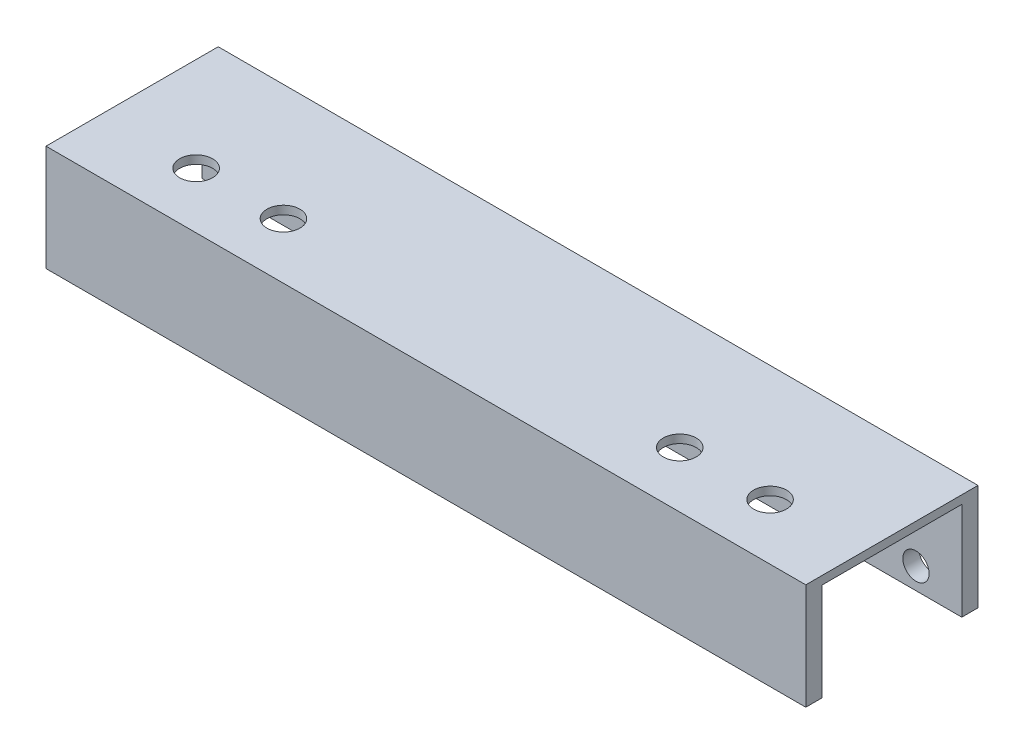
ISO-10303-21;
HEADER;
FILE_DESCRIPTION(('STEP AP214'),'2;1');
FILE_NAME('part.step','',(''),(''),'','','');
FILE_SCHEMA(('AUTOMOTIVE_DESIGN { 1 0 10303 214 1 1 1 1 }'));
ENDSEC;
DATA;
#1=APPLICATION_CONTEXT('core data for automotive mechanical design processes');
#2=APPLICATION_PROTOCOL_DEFINITION('international standard','automotive_design',2000,#1);
#3=PRODUCT_CONTEXT('',#1,'mechanical');
#4=PRODUCT('Part','Part','',(#3));
#5=PRODUCT_RELATED_PRODUCT_CATEGORY('part','',(#4));
#6=PRODUCT_DEFINITION_FORMATION('','',#4);
#7=PRODUCT_DEFINITION_CONTEXT('part definition',#1,'design');
#8=PRODUCT_DEFINITION('design','',#6,#7);
#9=PRODUCT_DEFINITION_SHAPE('','',#8);
#10=(LENGTH_UNIT() NAMED_UNIT(*) SI_UNIT(.MILLI.,.METRE.));
#11=(NAMED_UNIT(*) PLANE_ANGLE_UNIT() SI_UNIT($,.RADIAN.));
#12=(NAMED_UNIT(*) SI_UNIT($,.STERADIAN.) SOLID_ANGLE_UNIT());
#13=UNCERTAINTY_MEASURE_WITH_UNIT(LENGTH_MEASURE(1.E-05),#10,'distance_accuracy_value','');
#14=(GEOMETRIC_REPRESENTATION_CONTEXT(3) GLOBAL_UNCERTAINTY_ASSIGNED_CONTEXT((#13)) GLOBAL_UNIT_ASSIGNED_CONTEXT((#10,
#11,#12)) REPRESENTATION_CONTEXT('',''));
#15=CARTESIAN_POINT('',(0.,0.,0.));
#16=DIRECTION('',(0.,0.,1.));
#17=DIRECTION('',(1.,0.,0.));
#18=AXIS2_PLACEMENT_3D('',#15,#16,#17);
#19=CARTESIAN_POINT('',(0.,0.,31.67));
#20=DIRECTION('',(0.,1.,0.));
#21=DIRECTION('',(0.,0.,1.));
#22=AXIS2_PLACEMENT_3D('',#19,#20,#21);
#23=PLANE('',#22);
#24=DIRECTION('',(0.,0.,1.));
#25=VECTOR('',#24,1.);
#26=CARTESIAN_POINT('',(0.,0.,0.));
#27=LINE('',#26,#25);
#28=CARTESIAN_POINT('',(0.,0.,28.69));
#29=VERTEX_POINT('',#28);
#30=CARTESIAN_POINT('',(0.,0.,31.67));
#31=VERTEX_POINT('',#30);
#32=EDGE_CURVE('E141',#29,#31,#27,.T.);
#33=ORIENTED_EDGE('',*,*,#32,.F.);
#34=DIRECTION('',(-1.,0.,0.));
#35=VECTOR('',#34,1.);
#36=CARTESIAN_POINT('',(0.,0.,28.69));
#37=LINE('',#36,#35);
#38=CARTESIAN_POINT('',(139.73,0.,28.69));
#39=VERTEX_POINT('',#38);
#40=EDGE_CURVE('E121',#39,#29,#37,.T.);
#41=ORIENTED_EDGE('',*,*,#40,.F.);
#42=DIRECTION('',(0.,0.,-1.));
#43=VECTOR('',#42,1.);
#44=CARTESIAN_POINT('',(139.73,0.,0.));
#45=LINE('',#44,#43);
#46=CARTESIAN_POINT('',(139.73,0.,31.67));
#47=VERTEX_POINT('',#46);
#48=EDGE_CURVE('E144',#47,#39,#45,.T.);
#49=ORIENTED_EDGE('',*,*,#48,.F.);
#50=DIRECTION('',(1.,0.,0.));
#51=VECTOR('',#50,1.);
#52=CARTESIAN_POINT('',(0.,0.,31.67));
#53=LINE('',#52,#51);
#54=EDGE_CURVE('E140',#31,#47,#53,.T.);
#55=ORIENTED_EDGE('',*,*,#54,.F.);
#56=EDGE_LOOP('',(#33,#41,#49,#55));
#57=FACE_BOUND('',#56,.T.);
#58=ADVANCED_FACE('F32',(#57),#23,.F.);
#59=CARTESIAN_POINT('',(0.,19.5,0.));
#60=DIRECTION('',(1.,0.,0.));
#61=DIRECTION('',(0.,0.,-1.));
#62=AXIS2_PLACEMENT_3D('',#59,#60,#61);
#63=PLANE('',#62);
#64=DIRECTION('',(0.,0.,-1.));
#65=VECTOR('',#64,1.);
#66=CARTESIAN_POINT('',(0.,17.97,28.69));
#67=LINE('',#66,#65);
#68=CARTESIAN_POINT('',(0.,17.97,28.69));
#69=VERTEX_POINT('',#68);
#70=CARTESIAN_POINT('',(0.,17.97,2.98));
#71=VERTEX_POINT('',#70);
#72=EDGE_CURVE('E112',#69,#71,#67,.T.);
#73=ORIENTED_EDGE('',*,*,#72,.F.);
#74=DIRECTION('',(0.,-1.,0.));
#75=VECTOR('',#74,1.);
#76=CARTESIAN_POINT('',(0.,17.97,28.69));
#77=LINE('',#76,#75);
#78=EDGE_CURVE('E167',#69,#29,#77,.T.);
#79=ORIENTED_EDGE('',*,*,#78,.T.);
#80=ORIENTED_EDGE('',*,*,#32,.T.);
#81=DIRECTION('',(0.,-1.,0.));
#82=VECTOR('',#81,1.);
#83=CARTESIAN_POINT('',(0.,19.5,31.67));
#84=LINE('',#83,#82);
#85=CARTESIAN_POINT('',(0.,19.5,31.67));
#86=VERTEX_POINT('',#85);
#87=EDGE_CURVE('E11',#86,#31,#84,.T.);
#88=ORIENTED_EDGE('',*,*,#87,.F.);
#89=DIRECTION('',(0.,0.,1.));
#90=VECTOR('',#89,1.);
#91=CARTESIAN_POINT('',(0.,19.5,0.));
#92=LINE('',#91,#90);
#93=CARTESIAN_POINT('',(0.,19.5,0.));
#94=VERTEX_POINT('',#93);
#95=EDGE_CURVE('E132',#94,#86,#92,.T.);
#96=ORIENTED_EDGE('',*,*,#95,.F.);
#97=DIRECTION('',(0.,-1.,0.));
#98=VECTOR('',#97,1.);
#99=CARTESIAN_POINT('',(0.,19.5,0.));
#100=LINE('',#99,#98);
#101=CARTESIAN_POINT('',(0.,0.,0.));
#102=VERTEX_POINT('',#101);
#103=EDGE_CURVE('E138',#94,#102,#100,.T.);
#104=ORIENTED_EDGE('',*,*,#103,.T.);
#105=CARTESIAN_POINT('',(0.,0.,2.98));
#106=VERTEX_POINT('',#105);
#107=EDGE_CURVE('E125',#102,#106,#27,.T.);
#108=ORIENTED_EDGE('',*,*,#107,.T.);
#109=DIRECTION('',(0.,-1.,0.));
#110=VECTOR('',#109,1.);
#111=CARTESIAN_POINT('',(0.,17.97,2.98));
#112=LINE('',#111,#110);
#113=EDGE_CURVE('E47',#71,#106,#112,.T.);
#114=ORIENTED_EDGE('',*,*,#113,.F.);
#115=EDGE_LOOP('',(#73,#79,#80,#88,#96,#104,#108,#114));
#116=FACE_BOUND('',#115,.T.);
#117=ADVANCED_FACE('F34',(#116),#63,.F.);
#118=CARTESIAN_POINT('',(0.,19.5,31.67));
#119=DIRECTION('',(0.,0.,-1.));
#120=DIRECTION('',(-1.,0.,0.));
#121=AXIS2_PLACEMENT_3D('',#118,#119,#120);
#122=PLANE('',#121);
#123=ORIENTED_EDGE('',*,*,#54,.T.);
#124=DIRECTION('',(0.,-1.,0.));
#125=VECTOR('',#124,1.);
#126=CARTESIAN_POINT('',(139.73,19.5,31.67));
#127=LINE('',#126,#125);
#128=CARTESIAN_POINT('',(139.73,19.5,31.67));
#129=VERTEX_POINT('',#128);
#130=EDGE_CURVE('E40',#129,#47,#127,.T.);
#131=ORIENTED_EDGE('',*,*,#130,.F.);
#132=DIRECTION('',(1.,0.,0.));
#133=VECTOR('',#132,1.);
#134=CARTESIAN_POINT('',(0.,19.5,31.67));
#135=LINE('',#134,#133);
#136=EDGE_CURVE('E84',#86,#129,#135,.T.);
#137=ORIENTED_EDGE('',*,*,#136,.F.);
#138=ORIENTED_EDGE('',*,*,#87,.T.);
#139=EDGE_LOOP('',(#123,#131,#137,#138));
#140=FACE_BOUND('',#139,.T.);
#141=ADVANCED_FACE('F236',(#140),#122,.F.);
#142=CARTESIAN_POINT('',(139.73,19.5,0.));
#143=DIRECTION('',(-1.,0.,0.));
#144=DIRECTION('',(0.,0.,1.));
#145=AXIS2_PLACEMENT_3D('',#142,#143,#144);
#146=PLANE('',#145);
#147=ORIENTED_EDGE('',*,*,#48,.T.);
#148=DIRECTION('',(0.,-1.,0.));
#149=VECTOR('',#148,1.);
#150=CARTESIAN_POINT('',(139.73,17.97,28.69));
#151=LINE('',#150,#149);
#152=CARTESIAN_POINT('',(139.73,17.97,28.69));
#153=VERTEX_POINT('',#152);
#154=EDGE_CURVE('E127',#153,#39,#151,.T.);
#155=ORIENTED_EDGE('',*,*,#154,.F.);
#156=DIRECTION('',(0.,0.,1.));
#157=VECTOR('',#156,1.);
#158=CARTESIAN_POINT('',(139.73,17.97,28.69));
#159=LINE('',#158,#157);
#160=CARTESIAN_POINT('',(139.73,17.97,2.98));
#161=VERTEX_POINT('',#160);
#162=EDGE_CURVE('E111',#161,#153,#159,.T.);
#163=ORIENTED_EDGE('',*,*,#162,.F.);
#164=DIRECTION('',(0.,-1.,0.));
#165=VECTOR('',#164,1.);
#166=CARTESIAN_POINT('',(139.73,17.97,2.98));
#167=LINE('',#166,#165);
#168=CARTESIAN_POINT('',(139.73,0.,2.98));
#169=VERTEX_POINT('',#168);
#170=EDGE_CURVE('E108',#161,#169,#167,.T.);
#171=ORIENTED_EDGE('',*,*,#170,.T.);
#172=CARTESIAN_POINT('',(139.73,0.,0.));
#173=VERTEX_POINT('',#172);
#174=EDGE_CURVE('E143',#169,#173,#45,.T.);
#175=ORIENTED_EDGE('',*,*,#174,.T.);
#176=DIRECTION('',(0.,-1.,0.));
#177=VECTOR('',#176,1.);
#178=CARTESIAN_POINT('',(139.73,19.5,0.));
#179=LINE('',#178,#177);
#180=CARTESIAN_POINT('',(139.73,19.5,0.));
#181=VERTEX_POINT('',#180);
#182=EDGE_CURVE('E149',#181,#173,#179,.T.);
#183=ORIENTED_EDGE('',*,*,#182,.F.);
#184=DIRECTION('',(0.,0.,-1.));
#185=VECTOR('',#184,1.);
#186=CARTESIAN_POINT('',(139.73,19.5,0.));
#187=LINE('',#186,#185);
#188=EDGE_CURVE('E135',#129,#181,#187,.T.);
#189=ORIENTED_EDGE('',*,*,#188,.F.);
#190=ORIENTED_EDGE('',*,*,#130,.T.);
#191=EDGE_LOOP('',(#147,#155,#163,#171,#175,#183,#189,#190));
#192=FACE_BOUND('',#191,.T.);
#193=ADVANCED_FACE('F154',(#192),#146,.F.);
#194=CARTESIAN_POINT('',(0.,19.5,0.));
#195=DIRECTION('',(0.,0.,1.));
#196=DIRECTION('',(1.,0.,0.));
#197=AXIS2_PLACEMENT_3D('',#194,#195,#196);
#198=PLANE('',#197);
#199=CARTESIAN_POINT('',(131.3,3.93,0.));
#200=DIRECTION('',(0.,0.,-1.));
#201=DIRECTION('',(-1.,0.,0.));
#202=AXIS2_PLACEMENT_3D('',#199,#200,#201);
#203=CIRCLE('',#202,2.42000000000001);
#204=CARTESIAN_POINT('',(128.88,3.93,0.));
#205=VERTEX_POINT('',#204);
#206=EDGE_CURVE('E192',#205,#205,#203,.T.);
#207=ORIENTED_EDGE('',*,*,#206,.F.);
#208=EDGE_LOOP('',(#207));
#209=FACE_BOUND('',#208,.T.);
#210=CARTESIAN_POINT('',(96.59,3.93,0.));
#211=DIRECTION('',(0.,0.,-1.));
#212=DIRECTION('',(-1.,0.,0.));
#213=AXIS2_PLACEMENT_3D('',#210,#211,#212);
#214=CIRCLE('',#213,2.42000000000002);
#215=CARTESIAN_POINT('',(94.17,3.93,0.));
#216=VERTEX_POINT('',#215);
#217=EDGE_CURVE('E186',#216,#216,#214,.T.);
#218=ORIENTED_EDGE('',*,*,#217,.F.);
#219=EDGE_LOOP('',(#218));
#220=FACE_BOUND('',#219,.T.);
#221=CARTESIAN_POINT('',(43.14,3.93,0.));
#222=DIRECTION('',(0.,0.,-1.));
#223=DIRECTION('',(-1.,0.,0.));
#224=AXIS2_PLACEMENT_3D('',#221,#222,#223);
#225=CIRCLE('',#224,2.42000000000001);
#226=CARTESIAN_POINT('',(40.72,3.93,0.));
#227=VERTEX_POINT('',#226);
#228=EDGE_CURVE('E180',#227,#227,#225,.T.);
#229=ORIENTED_EDGE('',*,*,#228,.F.);
#230=EDGE_LOOP('',(#229));
#231=FACE_BOUND('',#230,.T.);
#232=CARTESIAN_POINT('',(8.43,3.93,0.));
#233=DIRECTION('',(0.,0.,-1.));
#234=DIRECTION('',(-1.,0.,0.));
#235=AXIS2_PLACEMENT_3D('',#232,#233,#234);
#236=CIRCLE('',#235,2.42000000000001);
#237=CARTESIAN_POINT('',(6.00999999999999,3.93,0.));
#238=VERTEX_POINT('',#237);
#239=EDGE_CURVE('E174',#238,#238,#236,.T.);
#240=ORIENTED_EDGE('',*,*,#239,.F.);
#241=EDGE_LOOP('',(#240));
#242=FACE_BOUND('',#241,.T.);
#243=DIRECTION('',(-1.,0.,0.));
#244=VECTOR('',#243,1.);
#245=CARTESIAN_POINT('',(0.,0.,0.));
#246=LINE('',#245,#244);
#247=EDGE_CURVE('E77',#173,#102,#246,.T.);
#248=ORIENTED_EDGE('',*,*,#247,.T.);
#249=ORIENTED_EDGE('',*,*,#103,.F.);
#250=DIRECTION('',(-1.,0.,0.));
#251=VECTOR('',#250,1.);
#252=CARTESIAN_POINT('',(0.,19.5,0.));
#253=LINE('',#252,#251);
#254=EDGE_CURVE('E56',#181,#94,#253,.T.);
#255=ORIENTED_EDGE('',*,*,#254,.F.);
#256=ORIENTED_EDGE('',*,*,#182,.T.);
#257=EDGE_LOOP('',(#248,#249,#255,#256));
#258=FACE_BOUND('',#257,.T.);
#259=ADVANCED_FACE('F227',(#209,#220,#231,#242,#258),#198,.F.);
#260=CARTESIAN_POINT('',(0.,19.5,31.67));
#261=DIRECTION('',(0.,1.,0.));
#262=DIRECTION('',(0.,0.,1.));
#263=AXIS2_PLACEMENT_3D('',#260,#261,#262);
#264=PLANE('',#263);
#265=CARTESIAN_POINT('',(122.87,19.5,21.38));
#266=DIRECTION('',(0.,1.,0.));
#267=DIRECTION('',(0.,0.,1.));
#268=AXIS2_PLACEMENT_3D('',#265,#266,#267);
#269=CIRCLE('',#268,3.03);
#270=CARTESIAN_POINT('',(122.87,19.5,24.41));
#271=VERTEX_POINT('',#270);
#272=EDGE_CURVE('E216',#271,#271,#269,.T.);
#273=ORIENTED_EDGE('',*,*,#272,.F.);
#274=EDGE_LOOP('',(#273));
#275=FACE_BOUND('',#274,.T.);
#276=CARTESIAN_POINT('',(106.26,19.5,21.38));
#277=DIRECTION('',(0.,1.,0.));
#278=DIRECTION('',(0.,0.,1.));
#279=AXIS2_PLACEMENT_3D('',#276,#277,#278);
#280=CIRCLE('',#279,3.03000000000002);
#281=CARTESIAN_POINT('',(106.26,19.5,24.41));
#282=VERTEX_POINT('',#281);
#283=EDGE_CURVE('E210',#282,#282,#280,.T.);
#284=ORIENTED_EDGE('',*,*,#283,.F.);
#285=EDGE_LOOP('',(#284));
#286=FACE_BOUND('',#285,.T.);
#287=CARTESIAN_POINT('',(33.38,19.5,21.38));
#288=DIRECTION('',(0.,1.,0.));
#289=DIRECTION('',(0.,0.,1.));
#290=AXIS2_PLACEMENT_3D('',#287,#288,#289);
#291=CIRCLE('',#290,3.03000000000001);
#292=CARTESIAN_POINT('',(33.38,19.5,24.41));
#293=VERTEX_POINT('',#292);
#294=EDGE_CURVE('E204',#293,#293,#291,.T.);
#295=ORIENTED_EDGE('',*,*,#294,.F.);
#296=EDGE_LOOP('',(#295));
#297=FACE_BOUND('',#296,.T.);
#298=CARTESIAN_POINT('',(17.32,19.5,21.38));
#299=DIRECTION('',(0.,1.,0.));
#300=DIRECTION('',(0.,0.,1.));
#301=AXIS2_PLACEMENT_3D('',#298,#299,#300);
#302=CIRCLE('',#301,3.03000000000002);
#303=CARTESIAN_POINT('',(17.32,19.5,24.41));
#304=VERTEX_POINT('',#303);
#305=EDGE_CURVE('E198',#304,#304,#302,.T.);
#306=ORIENTED_EDGE('',*,*,#305,.F.);
#307=EDGE_LOOP('',(#306));
#308=FACE_BOUND('',#307,.T.);
#309=ORIENTED_EDGE('',*,*,#95,.T.);
#310=ORIENTED_EDGE('',*,*,#136,.T.);
#311=ORIENTED_EDGE('',*,*,#188,.T.);
#312=ORIENTED_EDGE('',*,*,#254,.T.);
#313=EDGE_LOOP('',(#309,#310,#311,#312));
#314=FACE_BOUND('',#313,.T.);
#315=ADVANCED_FACE('F223',(#275,#286,#297,#308,#314),#264,.T.);
#316=ORIENTED_EDGE('',*,*,#174,.F.);
#317=DIRECTION('',(1.,0.,0.));
#318=VECTOR('',#317,1.);
#319=CARTESIAN_POINT('',(0.,0.,2.98));
#320=LINE('',#319,#318);
#321=EDGE_CURVE('E162',#106,#169,#320,.T.);
#322=ORIENTED_EDGE('',*,*,#321,.F.);
#323=ORIENTED_EDGE('',*,*,#107,.F.);
#324=ORIENTED_EDGE('',*,*,#247,.F.);
#325=EDGE_LOOP('',(#316,#322,#323,#324));
#326=FACE_BOUND('',#325,.T.);
#327=ADVANCED_FACE('F226',(#326),#23,.F.);
#328=CARTESIAN_POINT('',(0.,17.97,28.69));
#329=DIRECTION('',(0.,0.,1.));
#330=DIRECTION('',(1.,0.,0.));
#331=AXIS2_PLACEMENT_3D('',#328,#329,#330);
#332=PLANE('',#331);
#333=ORIENTED_EDGE('',*,*,#40,.T.);
#334=ORIENTED_EDGE('',*,*,#78,.F.);
#335=DIRECTION('',(-1.,0.,0.));
#336=VECTOR('',#335,1.);
#337=CARTESIAN_POINT('',(0.,17.97,28.69));
#338=LINE('',#337,#336);
#339=EDGE_CURVE('E118',#153,#69,#338,.T.);
#340=ORIENTED_EDGE('',*,*,#339,.F.);
#341=ORIENTED_EDGE('',*,*,#154,.T.);
#342=EDGE_LOOP('',(#333,#334,#340,#341));
#343=FACE_BOUND('',#342,.T.);
#344=ADVANCED_FACE('F168',(#343),#332,.F.);
#345=CARTESIAN_POINT('',(0.,17.97,2.98));
#346=DIRECTION('',(0.,0.,-1.));
#347=DIRECTION('',(-1.,0.,0.));
#348=AXIS2_PLACEMENT_3D('',#345,#346,#347);
#349=PLANE('',#348);
#350=CARTESIAN_POINT('',(131.3,3.93,2.98));
#351=DIRECTION('',(0.,0.,-1.));
#352=DIRECTION('',(-1.,0.,0.));
#353=AXIS2_PLACEMENT_3D('',#350,#351,#352);
#354=CIRCLE('',#353,2.42000000000001);
#355=CARTESIAN_POINT('',(128.88,3.93,2.98));
#356=VERTEX_POINT('',#355);
#357=EDGE_CURVE('E189',#356,#356,#354,.T.);
#358=ORIENTED_EDGE('',*,*,#357,.T.);
#359=EDGE_LOOP('',(#358));
#360=FACE_BOUND('',#359,.T.);
#361=CARTESIAN_POINT('',(96.59,3.93,2.98));
#362=DIRECTION('',(0.,0.,-1.));
#363=DIRECTION('',(-1.,0.,0.));
#364=AXIS2_PLACEMENT_3D('',#361,#362,#363);
#365=CIRCLE('',#364,2.42000000000002);
#366=CARTESIAN_POINT('',(94.17,3.93,2.98));
#367=VERTEX_POINT('',#366);
#368=EDGE_CURVE('E183',#367,#367,#365,.T.);
#369=ORIENTED_EDGE('',*,*,#368,.T.);
#370=EDGE_LOOP('',(#369));
#371=FACE_BOUND('',#370,.T.);
#372=CARTESIAN_POINT('',(43.14,3.93,2.98));
#373=DIRECTION('',(0.,0.,-1.));
#374=DIRECTION('',(-1.,0.,0.));
#375=AXIS2_PLACEMENT_3D('',#372,#373,#374);
#376=CIRCLE('',#375,2.42000000000001);
#377=CARTESIAN_POINT('',(40.72,3.93,2.98));
#378=VERTEX_POINT('',#377);
#379=EDGE_CURVE('E177',#378,#378,#376,.T.);
#380=ORIENTED_EDGE('',*,*,#379,.T.);
#381=EDGE_LOOP('',(#380));
#382=FACE_BOUND('',#381,.T.);
#383=CARTESIAN_POINT('',(8.43,3.93,2.98));
#384=DIRECTION('',(0.,0.,-1.));
#385=DIRECTION('',(-1.,0.,0.));
#386=AXIS2_PLACEMENT_3D('',#383,#384,#385);
#387=CIRCLE('',#386,2.42000000000001);
#388=CARTESIAN_POINT('',(6.00999999999999,3.93,2.98));
#389=VERTEX_POINT('',#388);
#390=EDGE_CURVE('E164',#389,#389,#387,.T.);
#391=ORIENTED_EDGE('',*,*,#390,.T.);
#392=EDGE_LOOP('',(#391));
#393=FACE_BOUND('',#392,.T.);
#394=ORIENTED_EDGE('',*,*,#321,.T.);
#395=ORIENTED_EDGE('',*,*,#170,.F.);
#396=DIRECTION('',(1.,0.,0.));
#397=VECTOR('',#396,1.);
#398=CARTESIAN_POINT('',(0.,17.97,2.98));
#399=LINE('',#398,#397);
#400=EDGE_CURVE('E104',#71,#161,#399,.T.);
#401=ORIENTED_EDGE('',*,*,#400,.F.);
#402=ORIENTED_EDGE('',*,*,#113,.T.);
#403=EDGE_LOOP('',(#394,#395,#401,#402));
#404=FACE_BOUND('',#403,.T.);
#405=ADVANCED_FACE('F106',(#360,#371,#382,#393,#404),#349,.F.);
#406=CARTESIAN_POINT('',(0.,17.97,2.98));
#407=DIRECTION('',(0.,-1.,0.));
#408=DIRECTION('',(0.,0.,-1.));
#409=AXIS2_PLACEMENT_3D('',#406,#407,#408);
#410=PLANE('',#409);
#411=CARTESIAN_POINT('',(122.87,17.97,21.38));
#412=DIRECTION('',(0.,-1.,0.));
#413=DIRECTION('',(0.,0.,-1.));
#414=AXIS2_PLACEMENT_3D('',#411,#412,#413);
#415=CIRCLE('',#414,3.03);
#416=CARTESIAN_POINT('',(122.87,17.97,18.35));
#417=VERTEX_POINT('',#416);
#418=EDGE_CURVE('E213',#417,#417,#415,.T.);
#419=ORIENTED_EDGE('',*,*,#418,.F.);
#420=EDGE_LOOP('',(#419));
#421=FACE_BOUND('',#420,.T.);
#422=CARTESIAN_POINT('',(106.26,17.97,21.38));
#423=DIRECTION('',(0.,-1.,0.));
#424=DIRECTION('',(0.,0.,-1.));
#425=AXIS2_PLACEMENT_3D('',#422,#423,#424);
#426=CIRCLE('',#425,3.03000000000002);
#427=CARTESIAN_POINT('',(106.26,17.97,18.35));
#428=VERTEX_POINT('',#427);
#429=EDGE_CURVE('E207',#428,#428,#426,.T.);
#430=ORIENTED_EDGE('',*,*,#429,.F.);
#431=EDGE_LOOP('',(#430));
#432=FACE_BOUND('',#431,.T.);
#433=CARTESIAN_POINT('',(33.38,17.97,21.38));
#434=DIRECTION('',(0.,-1.,0.));
#435=DIRECTION('',(0.,0.,-1.));
#436=AXIS2_PLACEMENT_3D('',#433,#434,#435);
#437=CIRCLE('',#436,3.03000000000001);
#438=CARTESIAN_POINT('',(33.38,17.97,18.35));
#439=VERTEX_POINT('',#438);
#440=EDGE_CURVE('E201',#439,#439,#437,.T.);
#441=ORIENTED_EDGE('',*,*,#440,.F.);
#442=EDGE_LOOP('',(#441));
#443=FACE_BOUND('',#442,.T.);
#444=CARTESIAN_POINT('',(17.32,17.97,21.38));
#445=DIRECTION('',(0.,-1.,0.));
#446=DIRECTION('',(0.,0.,-1.));
#447=AXIS2_PLACEMENT_3D('',#444,#445,#446);
#448=CIRCLE('',#447,3.03000000000002);
#449=CARTESIAN_POINT('',(17.32,17.97,18.35));
#450=VERTEX_POINT('',#449);
#451=EDGE_CURVE('E195',#450,#450,#448,.T.);
#452=ORIENTED_EDGE('',*,*,#451,.F.);
#453=EDGE_LOOP('',(#452));
#454=FACE_BOUND('',#453,.T.);
#455=ORIENTED_EDGE('',*,*,#72,.T.);
#456=ORIENTED_EDGE('',*,*,#400,.T.);
#457=ORIENTED_EDGE('',*,*,#162,.T.);
#458=ORIENTED_EDGE('',*,*,#339,.T.);
#459=EDGE_LOOP('',(#455,#456,#457,#458));
#460=FACE_BOUND('',#459,.T.);
#461=ADVANCED_FACE('F116',(#421,#432,#443,#454,#460),#410,.T.);
#462=CARTESIAN_POINT('',(8.43,3.93,0.));
#463=DIRECTION('',(0.,0.,-1.));
#464=DIRECTION('',(-1.,0.,0.));
#465=AXIS2_PLACEMENT_3D('',#462,#463,#464);
#466=CYLINDRICAL_SURFACE('',#465,2.42000000000001);
#467=ORIENTED_EDGE('',*,*,#390,.F.);
#468=EDGE_LOOP('',(#467));
#469=FACE_BOUND('',#468,.T.);
#470=ORIENTED_EDGE('',*,*,#239,.T.);
#471=EDGE_LOOP('',(#470));
#472=FACE_BOUND('',#471,.T.);
#473=ADVANCED_FACE('F266',(#469,#472),#466,.F.);
#474=CARTESIAN_POINT('',(43.14,3.93,0.));
#475=DIRECTION('',(0.,0.,-1.));
#476=DIRECTION('',(-1.,0.,0.));
#477=AXIS2_PLACEMENT_3D('',#474,#475,#476);
#478=CYLINDRICAL_SURFACE('',#477,2.42000000000001);
#479=ORIENTED_EDGE('',*,*,#379,.F.);
#480=EDGE_LOOP('',(#479));
#481=FACE_BOUND('',#480,.T.);
#482=ORIENTED_EDGE('',*,*,#228,.T.);
#483=EDGE_LOOP('',(#482));
#484=FACE_BOUND('',#483,.T.);
#485=ADVANCED_FACE('F268',(#481,#484),#478,.F.);
#486=CARTESIAN_POINT('',(96.59,3.93,0.));
#487=DIRECTION('',(0.,0.,-1.));
#488=DIRECTION('',(-1.,0.,0.));
#489=AXIS2_PLACEMENT_3D('',#486,#487,#488);
#490=CYLINDRICAL_SURFACE('',#489,2.42000000000002);
#491=ORIENTED_EDGE('',*,*,#368,.F.);
#492=EDGE_LOOP('',(#491));
#493=FACE_BOUND('',#492,.T.);
#494=ORIENTED_EDGE('',*,*,#217,.T.);
#495=EDGE_LOOP('',(#494));
#496=FACE_BOUND('',#495,.T.);
#497=ADVANCED_FACE('F275',(#493,#496),#490,.F.);
#498=CARTESIAN_POINT('',(131.3,3.93,0.));
#499=DIRECTION('',(0.,0.,-1.));
#500=DIRECTION('',(-1.,0.,0.));
#501=AXIS2_PLACEMENT_3D('',#498,#499,#500);
#502=CYLINDRICAL_SURFACE('',#501,2.42000000000001);
#503=ORIENTED_EDGE('',*,*,#357,.F.);
#504=EDGE_LOOP('',(#503));
#505=FACE_BOUND('',#504,.T.);
#506=ORIENTED_EDGE('',*,*,#206,.T.);
#507=EDGE_LOOP('',(#506));
#508=FACE_BOUND('',#507,.T.);
#509=ADVANCED_FACE('F297',(#505,#508),#502,.F.);
#510=CARTESIAN_POINT('',(17.32,19.5,21.38));
#511=DIRECTION('',(0.,1.,0.));
#512=DIRECTION('',(0.,0.,1.));
#513=AXIS2_PLACEMENT_3D('',#510,#511,#512);
#514=CYLINDRICAL_SURFACE('',#513,3.03000000000002);
#515=ORIENTED_EDGE('',*,*,#305,.T.);
#516=EDGE_LOOP('',(#515));
#517=FACE_BOUND('',#516,.T.);
#518=ORIENTED_EDGE('',*,*,#451,.T.);
#519=EDGE_LOOP('',(#518));
#520=FACE_BOUND('',#519,.T.);
#521=ADVANCED_FACE('F301',(#517,#520),#514,.F.);
#522=CARTESIAN_POINT('',(33.38,19.5,21.38));
#523=DIRECTION('',(0.,1.,0.));
#524=DIRECTION('',(0.,0.,1.));
#525=AXIS2_PLACEMENT_3D('',#522,#523,#524);
#526=CYLINDRICAL_SURFACE('',#525,3.03000000000001);
#527=ORIENTED_EDGE('',*,*,#294,.T.);
#528=EDGE_LOOP('',(#527));
#529=FACE_BOUND('',#528,.T.);
#530=ORIENTED_EDGE('',*,*,#440,.T.);
#531=EDGE_LOOP('',(#530));
#532=FACE_BOUND('',#531,.T.);
#533=ADVANCED_FACE('F307',(#529,#532),#526,.F.);
#534=CARTESIAN_POINT('',(106.26,19.5,21.38));
#535=DIRECTION('',(0.,1.,0.));
#536=DIRECTION('',(0.,0.,1.));
#537=AXIS2_PLACEMENT_3D('',#534,#535,#536);
#538=CYLINDRICAL_SURFACE('',#537,3.03000000000002);
#539=ORIENTED_EDGE('',*,*,#283,.T.);
#540=EDGE_LOOP('',(#539));
#541=FACE_BOUND('',#540,.T.);
#542=ORIENTED_EDGE('',*,*,#429,.T.);
#543=EDGE_LOOP('',(#542));
#544=FACE_BOUND('',#543,.T.);
#545=ADVANCED_FACE('F311',(#541,#544),#538,.F.);
#546=CARTESIAN_POINT('',(122.87,19.5,21.38));
#547=DIRECTION('',(0.,1.,0.));
#548=DIRECTION('',(0.,0.,1.));
#549=AXIS2_PLACEMENT_3D('',#546,#547,#548);
#550=CYLINDRICAL_SURFACE('',#549,3.03);
#551=ORIENTED_EDGE('',*,*,#272,.T.);
#552=EDGE_LOOP('',(#551));
#553=FACE_BOUND('',#552,.T.);
#554=ORIENTED_EDGE('',*,*,#418,.T.);
#555=EDGE_LOOP('',(#554));
#556=FACE_BOUND('',#555,.T.);
#557=ADVANCED_FACE('F220',(#553,#556),#550,.F.);
#558=CLOSED_SHELL('',(#58,#117,#141,#193,#259,#315,#327,#344,#405,#461,#473,#485,#497,#509,#521,
#533,#545,#557));
#559=MANIFOLD_SOLID_BREP('B2',#558);
#560=ADVANCED_BREP_SHAPE_REPRESENTATION('',(#18,#559),#14);
#561=SHAPE_DEFINITION_REPRESENTATION(#9,#560);
ENDSEC;
END-ISO-10303-21;
